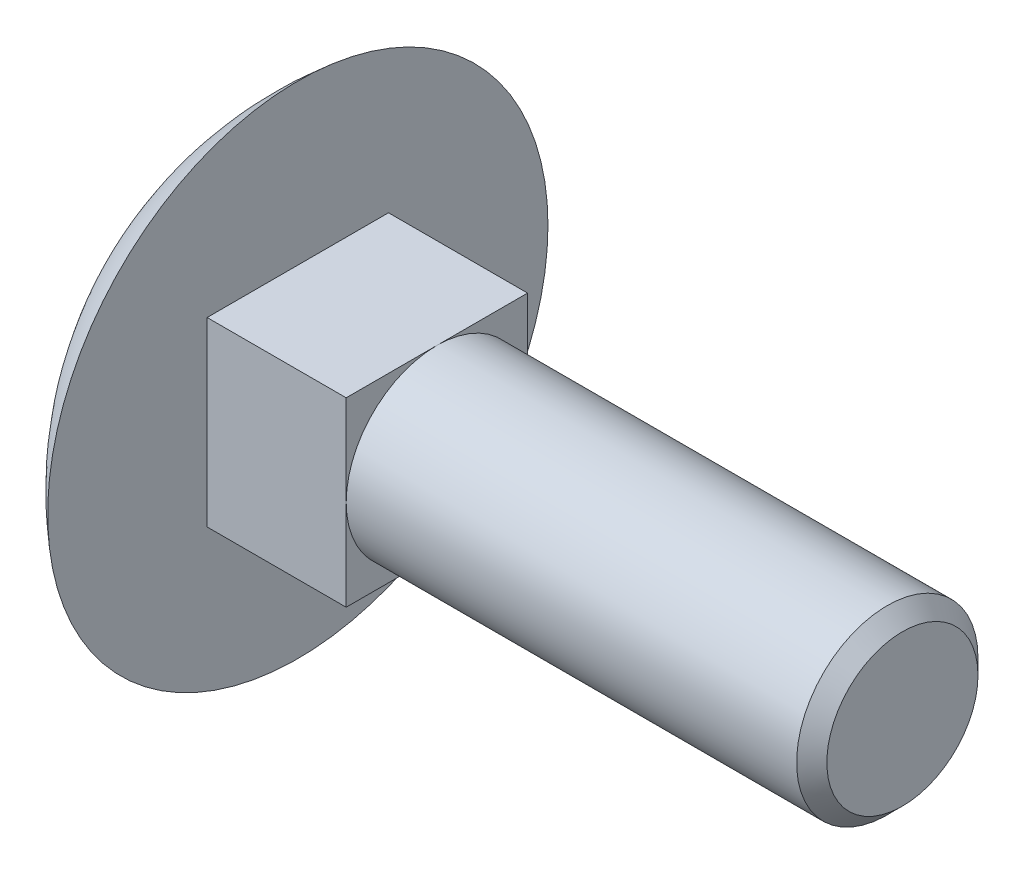
ISO-10303-21;
HEADER;
FILE_DESCRIPTION(('STEP AP214'),'2;1');
FILE_NAME('part.step','',(''),(''),'','','');
FILE_SCHEMA(('AUTOMOTIVE_DESIGN { 1 0 10303 214 1 1 1 1 }'));
ENDSEC;
DATA;
#1=APPLICATION_CONTEXT('core data for automotive mechanical design processes');
#2=APPLICATION_PROTOCOL_DEFINITION('international standard','automotive_design',2000,#1);
#3=PRODUCT_CONTEXT('',#1,'mechanical');
#4=PRODUCT('Part','Part','',(#3));
#5=PRODUCT_RELATED_PRODUCT_CATEGORY('part','',(#4));
#6=PRODUCT_DEFINITION_FORMATION('','',#4);
#7=PRODUCT_DEFINITION_CONTEXT('part definition',#1,'design');
#8=PRODUCT_DEFINITION('design','',#6,#7);
#9=PRODUCT_DEFINITION_SHAPE('','',#8);
#10=(LENGTH_UNIT() NAMED_UNIT(*) SI_UNIT(.MILLI.,.METRE.));
#11=(NAMED_UNIT(*) PLANE_ANGLE_UNIT() SI_UNIT($,.RADIAN.));
#12=(NAMED_UNIT(*) SI_UNIT($,.STERADIAN.) SOLID_ANGLE_UNIT());
#13=UNCERTAINTY_MEASURE_WITH_UNIT(LENGTH_MEASURE(1.E-05),#10,'distance_accuracy_value','');
#14=(GEOMETRIC_REPRESENTATION_CONTEXT(3) GLOBAL_UNCERTAINTY_ASSIGNED_CONTEXT((#13)) GLOBAL_UNIT_ASSIGNED_CONTEXT((#10,
#11,#12)) REPRESENTATION_CONTEXT('',''));
#15=CARTESIAN_POINT('',(0.,0.,0.));
#16=DIRECTION('',(0.,0.,1.));
#17=DIRECTION('',(1.,0.,0.));
#18=AXIS2_PLACEMENT_3D('',#15,#16,#17);
#19=CARTESIAN_POINT('',(4.6,-3.,3.));
#20=DIRECTION('',(1.,0.,0.));
#21=DIRECTION('',(0.,0.,-1.));
#22=AXIS2_PLACEMENT_3D('',#19,#20,#21);
#23=PLANE('',#22);
#24=CARTESIAN_POINT('',(4.6,0.,0.));
#25=DIRECTION('',(1.,0.,0.));
#26=DIRECTION('',(0.,0.,-1.));
#27=AXIS2_PLACEMENT_3D('',#24,#25,#26);
#28=CIRCLE('',#27,3.);
#29=CARTESIAN_POINT('',(4.6,0.,-3.));
#30=VERTEX_POINT('',#29);
#31=CARTESIAN_POINT('',(4.6,3.,0.));
#32=VERTEX_POINT('',#31);
#33=EDGE_CURVE('E103',#30,#32,#28,.T.);
#34=ORIENTED_EDGE('',*,*,#33,.F.);
#35=DIRECTION('',(0.,1.,0.));
#36=VECTOR('',#35,1.);
#37=CARTESIAN_POINT('',(4.6,3.,-3.));
#38=LINE('',#37,#36);
#39=CARTESIAN_POINT('',(4.6,3.,-3.));
#40=VERTEX_POINT('',#39);
#41=EDGE_CURVE('E91',#30,#40,#38,.T.);
#42=ORIENTED_EDGE('',*,*,#41,.T.);
#43=DIRECTION('',(0.,0.,1.));
#44=VECTOR('',#43,1.);
#45=CARTESIAN_POINT('',(4.6,3.,3.));
#46=LINE('',#45,#44);
#47=EDGE_CURVE('E104',#40,#32,#46,.T.);
#48=ORIENTED_EDGE('',*,*,#47,.T.);
#49=EDGE_LOOP('',(#34,#42,#48));
#50=FACE_BOUND('',#49,.T.);
#51=ADVANCED_FACE('F31',(#50),#23,.T.);
#52=CARTESIAN_POINT('',(4.6,0.,3.));
#53=VERTEX_POINT('',#52);
#54=EDGE_CURVE('E46',#32,#53,#28,.T.);
#55=ORIENTED_EDGE('',*,*,#54,.F.);
#56=CARTESIAN_POINT('',(4.6,3.,3.));
#57=VERTEX_POINT('',#56);
#58=EDGE_CURVE('E90',#32,#57,#46,.T.);
#59=ORIENTED_EDGE('',*,*,#58,.T.);
#60=DIRECTION('',(0.,-1.,0.));
#61=VECTOR('',#60,1.);
#62=CARTESIAN_POINT('',(4.6,3.,3.));
#63=LINE('',#62,#61);
#64=EDGE_CURVE('E116',#57,#53,#63,.T.);
#65=ORIENTED_EDGE('',*,*,#64,.T.);
#66=EDGE_LOOP('',(#55,#59,#65));
#67=FACE_BOUND('',#66,.T.);
#68=ADVANCED_FACE('F149',(#67),#23,.T.);
#69=CARTESIAN_POINT('',(4.6,-3.,0.));
#70=VERTEX_POINT('',#69);
#71=EDGE_CURVE('E110',#53,#70,#28,.T.);
#72=ORIENTED_EDGE('',*,*,#71,.F.);
#73=CARTESIAN_POINT('',(4.6,-3.,3.));
#74=VERTEX_POINT('',#73);
#75=EDGE_CURVE('E118',#53,#74,#63,.T.);
#76=ORIENTED_EDGE('',*,*,#75,.T.);
#77=DIRECTION('',(0.,0.,-1.));
#78=VECTOR('',#77,1.);
#79=CARTESIAN_POINT('',(4.6,-3.,3.));
#80=LINE('',#79,#78);
#81=EDGE_CURVE('E101',#74,#70,#80,.T.);
#82=ORIENTED_EDGE('',*,*,#81,.T.);
#83=EDGE_LOOP('',(#72,#76,#82));
#84=FACE_BOUND('',#83,.T.);
#85=ADVANCED_FACE('F154',(#84),#23,.T.);
#86=CARTESIAN_POINT('',(0.,0.,0.));
#87=DIRECTION('',(1.,0.,0.));
#88=DIRECTION('',(0.,0.,-1.));
#89=AXIS2_PLACEMENT_3D('',#86,#87,#88);
#90=PLANE('',#89);
#91=CARTESIAN_POINT('',(0.,0.,0.));
#92=DIRECTION('',(1.,0.,0.));
#93=DIRECTION('',(0.,0.,-1.));
#94=AXIS2_PLACEMENT_3D('',#91,#92,#93);
#95=CIRCLE('',#94,8.275);
#96=CARTESIAN_POINT('',(0.,0.,-8.275));
#97=VERTEX_POINT('',#96);
#98=EDGE_CURVE('E111',#97,#97,#95,.T.);
#99=ORIENTED_EDGE('',*,*,#98,.T.);
#100=EDGE_LOOP('',(#99));
#101=FACE_BOUND('',#100,.T.);
#102=DIRECTION('',(0.,0.,-1.));
#103=VECTOR('',#102,1.);
#104=CARTESIAN_POINT('',(0.,-3.,3.));
#105=LINE('',#104,#103);
#106=CARTESIAN_POINT('',(0.,-3.,3.));
#107=VERTEX_POINT('',#106);
#108=CARTESIAN_POINT('',(0.,-3.,-3.));
#109=VERTEX_POINT('',#108);
#110=EDGE_CURVE('E125',#107,#109,#105,.T.);
#111=ORIENTED_EDGE('',*,*,#110,.F.);
#112=DIRECTION('',(0.,-1.,0.));
#113=VECTOR('',#112,1.);
#114=CARTESIAN_POINT('',(0.,3.,3.));
#115=LINE('',#114,#113);
#116=CARTESIAN_POINT('',(0.,3.,3.));
#117=VERTEX_POINT('',#116);
#118=EDGE_CURVE('E106',#117,#107,#115,.T.);
#119=ORIENTED_EDGE('',*,*,#118,.F.);
#120=DIRECTION('',(0.,0.,1.));
#121=VECTOR('',#120,1.);
#122=CARTESIAN_POINT('',(0.,3.,3.));
#123=LINE('',#122,#121);
#124=CARTESIAN_POINT('',(0.,3.,-3.));
#125=VERTEX_POINT('',#124);
#126=EDGE_CURVE('E129',#125,#117,#123,.T.);
#127=ORIENTED_EDGE('',*,*,#126,.F.);
#128=DIRECTION('',(0.,1.,0.));
#129=VECTOR('',#128,1.);
#130=CARTESIAN_POINT('',(0.,3.,-3.));
#131=LINE('',#130,#129);
#132=EDGE_CURVE('E127',#109,#125,#131,.T.);
#133=ORIENTED_EDGE('',*,*,#132,.F.);
#134=EDGE_LOOP('',(#111,#119,#127,#133));
#135=FACE_BOUND('',#134,.T.);
#136=ADVANCED_FACE('F166',(#101,#135),#90,.T.);
#137=CARTESIAN_POINT('',(6.88417847938144,0.,0.));
#138=DIRECTION('',(1.,0.,0.));
#139=DIRECTION('',(0.,0.,-1.));
#140=AXIS2_PLACEMENT_3D('',#137,#138,#139);
#141=SPHERICAL_SURFACE('',#140,10.7641784793814);
#142=ORIENTED_EDGE('',*,*,#98,.F.);
#143=EDGE_LOOP('',(#142));
#144=FACE_BOUND('',#143,.T.);
#145=ADVANCED_FACE('F171',(#144),#141,.T.);
#146=CARTESIAN_POINT('',(4.6,3.,3.));
#147=DIRECTION('',(0.,0.,-1.));
#148=DIRECTION('',(0.,1.,0.));
#149=AXIS2_PLACEMENT_3D('',#146,#147,#148);
#150=PLANE('',#149);
#151=ORIENTED_EDGE('',*,*,#118,.T.);
#152=DIRECTION('',(-1.,0.,0.));
#153=VECTOR('',#152,1.);
#154=CARTESIAN_POINT('',(4.6,-3.,3.));
#155=LINE('',#154,#153);
#156=EDGE_CURVE('E113',#74,#107,#155,.T.);
#157=ORIENTED_EDGE('',*,*,#156,.F.);
#158=ORIENTED_EDGE('',*,*,#75,.F.);
#159=ORIENTED_EDGE('',*,*,#64,.F.);
#160=DIRECTION('',(-1.,0.,0.));
#161=VECTOR('',#160,1.);
#162=CARTESIAN_POINT('',(4.6,3.,3.));
#163=LINE('',#162,#161);
#164=EDGE_CURVE('E122',#57,#117,#163,.T.);
#165=ORIENTED_EDGE('',*,*,#164,.T.);
#166=EDGE_LOOP('',(#151,#157,#158,#159,#165));
#167=FACE_BOUND('',#166,.T.);
#168=ADVANCED_FACE('F178',(#167),#150,.F.);
#169=CARTESIAN_POINT('',(4.6,-3.,3.));
#170=DIRECTION('',(0.,1.,0.));
#171=DIRECTION('',(0.,0.,1.));
#172=AXIS2_PLACEMENT_3D('',#169,#170,#171);
#173=PLANE('',#172);
#174=ORIENTED_EDGE('',*,*,#110,.T.);
#175=DIRECTION('',(-1.,0.,0.));
#176=VECTOR('',#175,1.);
#177=CARTESIAN_POINT('',(4.6,-3.,-3.));
#178=LINE('',#177,#176);
#179=CARTESIAN_POINT('',(4.6,-3.,-3.));
#180=VERTEX_POINT('',#179);
#181=EDGE_CURVE('E134',#180,#109,#178,.T.);
#182=ORIENTED_EDGE('',*,*,#181,.F.);
#183=EDGE_CURVE('E86',#70,#180,#80,.T.);
#184=ORIENTED_EDGE('',*,*,#183,.F.);
#185=ORIENTED_EDGE('',*,*,#81,.F.);
#186=ORIENTED_EDGE('',*,*,#156,.T.);
#187=EDGE_LOOP('',(#174,#182,#184,#185,#186));
#188=FACE_BOUND('',#187,.T.);
#189=ADVANCED_FACE('F186',(#188),#173,.F.);
#190=CARTESIAN_POINT('',(4.6,3.,-3.));
#191=DIRECTION('',(0.,0.,1.));
#192=DIRECTION('',(0.,-1.,0.));
#193=AXIS2_PLACEMENT_3D('',#190,#191,#192);
#194=PLANE('',#193);
#195=ORIENTED_EDGE('',*,*,#132,.T.);
#196=DIRECTION('',(-1.,0.,0.));
#197=VECTOR('',#196,1.);
#198=CARTESIAN_POINT('',(4.6,3.,-3.));
#199=LINE('',#198,#197);
#200=EDGE_CURVE('E97',#40,#125,#199,.T.);
#201=ORIENTED_EDGE('',*,*,#200,.F.);
#202=ORIENTED_EDGE('',*,*,#41,.F.);
#203=EDGE_CURVE('E83',#180,#30,#38,.T.);
#204=ORIENTED_EDGE('',*,*,#203,.F.);
#205=ORIENTED_EDGE('',*,*,#181,.T.);
#206=EDGE_LOOP('',(#195,#201,#202,#204,#205));
#207=FACE_BOUND('',#206,.T.);
#208=ADVANCED_FACE('F96',(#207),#194,.F.);
#209=CARTESIAN_POINT('',(4.6,3.,3.));
#210=DIRECTION('',(0.,-1.,0.));
#211=DIRECTION('',(0.,0.,-1.));
#212=AXIS2_PLACEMENT_3D('',#209,#210,#211);
#213=PLANE('',#212);
#214=ORIENTED_EDGE('',*,*,#126,.T.);
#215=ORIENTED_EDGE('',*,*,#164,.F.);
#216=ORIENTED_EDGE('',*,*,#58,.F.);
#217=ORIENTED_EDGE('',*,*,#47,.F.);
#218=ORIENTED_EDGE('',*,*,#200,.T.);
#219=EDGE_LOOP('',(#214,#215,#216,#217,#218));
#220=FACE_BOUND('',#219,.T.);
#221=ADVANCED_FACE('F158',(#220),#213,.F.);
#222=EDGE_CURVE('E54',#70,#30,#28,.T.);
#223=ORIENTED_EDGE('',*,*,#222,.F.);
#224=ORIENTED_EDGE('',*,*,#183,.T.);
#225=ORIENTED_EDGE('',*,*,#203,.T.);
#226=EDGE_LOOP('',(#223,#224,#225));
#227=FACE_BOUND('',#226,.T.);
#228=ADVANCED_FACE('F85',(#227),#23,.T.);
#229=CARTESIAN_POINT('',(20.,0.,0.));
#230=DIRECTION('',(-1.,0.,0.));
#231=DIRECTION('',(0.,0.,1.));
#232=AXIS2_PLACEMENT_3D('',#229,#230,#231);
#233=CYLINDRICAL_SURFACE('',#232,3.);
#234=CARTESIAN_POINT('',(19.5,0.,0.));
#235=DIRECTION('',(1.,0.,0.));
#236=DIRECTION('',(0.,0.,-1.));
#237=AXIS2_PLACEMENT_3D('',#234,#235,#236);
#238=CIRCLE('',#237,3.);
#239=CARTESIAN_POINT('',(19.5,0.,-3.));
#240=VERTEX_POINT('',#239);
#241=EDGE_CURVE('E11',#240,#240,#238,.F.);
#242=ORIENTED_EDGE('',*,*,#241,.T.);
#243=EDGE_LOOP('',(#242));
#244=FACE_BOUND('',#243,.T.);
#245=ORIENTED_EDGE('',*,*,#33,.T.);
#246=ORIENTED_EDGE('',*,*,#54,.T.);
#247=ORIENTED_EDGE('',*,*,#71,.T.);
#248=ORIENTED_EDGE('',*,*,#222,.T.);
#249=EDGE_LOOP('',(#245,#246,#247,#248));
#250=FACE_BOUND('',#249,.T.);
#251=ADVANCED_FACE('F109',(#244,#250),#233,.T.);
#252=CARTESIAN_POINT('',(20.,0.,0.));
#253=DIRECTION('',(1.,0.,0.));
#254=DIRECTION('',(0.,0.,-1.));
#255=AXIS2_PLACEMENT_3D('',#252,#253,#254);
#256=PLANE('',#255);
#257=CARTESIAN_POINT('',(20.,0.,0.));
#258=DIRECTION('',(1.,0.,0.));
#259=DIRECTION('',(0.,0.,-1.));
#260=AXIS2_PLACEMENT_3D('',#257,#258,#259);
#261=CIRCLE('',#260,2.50000000000001);
#262=CARTESIAN_POINT('',(20.,0.,-2.50000000000001));
#263=VERTEX_POINT('',#262);
#264=EDGE_CURVE('E39',#263,#263,#261,.T.);
#265=ORIENTED_EDGE('',*,*,#264,.T.);
#266=EDGE_LOOP('',(#265));
#267=FACE_BOUND('',#266,.T.);
#268=ADVANCED_FACE('F139',(#267),#256,.T.);
#269=CARTESIAN_POINT('',(20.,0.,0.));
#270=DIRECTION('',(-1.,0.,0.));
#271=DIRECTION('',(0.,0.,1.));
#272=AXIS2_PLACEMENT_3D('',#269,#270,#271);
#273=CONICAL_SURFACE('',#272,2.50000000000001,0.785398163397447);
#274=ORIENTED_EDGE('',*,*,#241,.F.);
#275=EDGE_LOOP('',(#274));
#276=FACE_BOUND('',#275,.T.);
#277=ORIENTED_EDGE('',*,*,#264,.F.);
#278=EDGE_LOOP('',(#277));
#279=FACE_BOUND('',#278,.T.);
#280=ADVANCED_FACE('F33',(#276,#279),#273,.T.);
#281=CLOSED_SHELL('',(#51,#68,#85,#136,#145,#168,#189,#208,#221,#228,#251,#268,#280));
#282=MANIFOLD_SOLID_BREP('B2',#281);
#283=ADVANCED_BREP_SHAPE_REPRESENTATION('',(#18,#282),#14);
#284=SHAPE_DEFINITION_REPRESENTATION(#9,#283);
ENDSEC;
END-ISO-10303-21;
